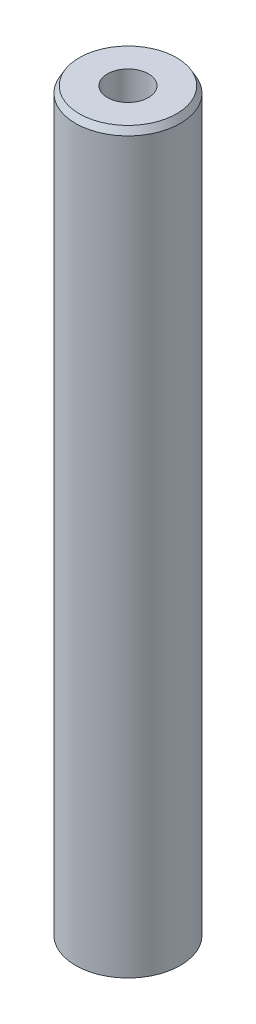
ISO-10303-21;
HEADER;
FILE_DESCRIPTION(('STEP AP214'),'2;1');
FILE_NAME('part.step','',(''),(''),'','','');
FILE_SCHEMA(('AUTOMOTIVE_DESIGN { 1 0 10303 214 1 1 1 1 }'));
ENDSEC;
DATA;
#1=APPLICATION_CONTEXT('core data for automotive mechanical design processes');
#2=APPLICATION_PROTOCOL_DEFINITION('international standard','automotive_design',2000,#1);
#3=PRODUCT_CONTEXT('',#1,'mechanical');
#4=PRODUCT('Part','Part','',(#3));
#5=PRODUCT_RELATED_PRODUCT_CATEGORY('part','',(#4));
#6=PRODUCT_DEFINITION_FORMATION('','',#4);
#7=PRODUCT_DEFINITION_CONTEXT('part definition',#1,'design');
#8=PRODUCT_DEFINITION('design','',#6,#7);
#9=PRODUCT_DEFINITION_SHAPE('','',#8);
#10=(LENGTH_UNIT() NAMED_UNIT(*) SI_UNIT(.MILLI.,.METRE.));
#11=(NAMED_UNIT(*) PLANE_ANGLE_UNIT() SI_UNIT($,.RADIAN.));
#12=(NAMED_UNIT(*) SI_UNIT($,.STERADIAN.) SOLID_ANGLE_UNIT());
#13=UNCERTAINTY_MEASURE_WITH_UNIT(LENGTH_MEASURE(1.E-05),#10,'distance_accuracy_value','');
#14=(GEOMETRIC_REPRESENTATION_CONTEXT(3) GLOBAL_UNCERTAINTY_ASSIGNED_CONTEXT((#13)) GLOBAL_UNIT_ASSIGNED_CONTEXT((#10,
#11,#12)) REPRESENTATION_CONTEXT('',''));
#15=CARTESIAN_POINT('',(0.,0.,0.));
#16=DIRECTION('',(0.,0.,1.));
#17=DIRECTION('',(1.,0.,0.));
#18=AXIS2_PLACEMENT_3D('',#15,#16,#17);
#19=CARTESIAN_POINT('',(0.,600.,0.));
#20=DIRECTION('',(0.,-1.,0.));
#21=DIRECTION('',(0.,0.,-1.));
#22=AXIS2_PLACEMENT_3D('',#19,#20,#21);
#23=CYLINDRICAL_SURFACE('',#22,42.5);
#24=CARTESIAN_POINT('',(0.,594.740714025713,0.));
#25=DIRECTION('',(0.,1.,0.));
#26=DIRECTION('',(0.,0.,1.));
#27=AXIS2_PLACEMENT_3D('',#24,#25,#26);
#28=CIRCLE('',#27,42.5);
#29=CARTESIAN_POINT('',(0.,594.740714025713,42.5));
#30=VERTEX_POINT('',#29);
#31=EDGE_CURVE('E50',#30,#30,#28,.F.);
#32=ORIENTED_EDGE('',*,*,#31,.T.);
#33=EDGE_LOOP('',(#32));
#34=FACE_BOUND('',#33,.T.);
#35=CARTESIAN_POINT('',(0.,3.03645017299958,0.));
#36=DIRECTION('',(0.,1.,0.));
#37=DIRECTION('',(0.,0.,1.));
#38=AXIS2_PLACEMENT_3D('',#35,#36,#37);
#39=CIRCLE('',#38,42.5);
#40=CARTESIAN_POINT('',(0.,3.03645017299958,42.5));
#41=VERTEX_POINT('',#40);
#42=EDGE_CURVE('E51',#41,#41,#39,.T.);
#43=ORIENTED_EDGE('',*,*,#42,.T.);
#44=EDGE_LOOP('',(#43));
#45=FACE_BOUND('',#44,.T.);
#46=ADVANCED_FACE('F39',(#34,#45),#23,.T.);
#47=CARTESIAN_POINT('',(0.,600.,0.));
#48=DIRECTION('',(0.,1.,0.));
#49=DIRECTION('',(0.,0.,1.));
#50=AXIS2_PLACEMENT_3D('',#47,#48,#49);
#51=PLANE('',#50);
#52=CARTESIAN_POINT('',(0.,600.,0.));
#53=DIRECTION('',(0.,1.,0.));
#54=DIRECTION('',(0.,0.,1.));
#55=AXIS2_PLACEMENT_3D('',#52,#53,#54);
#56=CIRCLE('',#55,39.4635498270004);
#57=CARTESIAN_POINT('',(0.,600.,39.4635498270004));
#58=VERTEX_POINT('',#57);
#59=EDGE_CURVE('E54',#58,#58,#56,.T.);
#60=ORIENTED_EDGE('',*,*,#59,.T.);
#61=EDGE_LOOP('',(#60));
#62=FACE_BOUND('',#61,.T.);
#63=CARTESIAN_POINT('',(0.,600.,0.));
#64=DIRECTION('',(0.,1.,0.));
#65=DIRECTION('',(0.,0.,1.));
#66=AXIS2_PLACEMENT_3D('',#63,#64,#65);
#67=CIRCLE('',#66,16.6773726557165);
#68=CARTESIAN_POINT('',(0.,600.,16.6773726557165));
#69=VERTEX_POINT('',#68);
#70=EDGE_CURVE('E58',#69,#69,#67,.T.);
#71=ORIENTED_EDGE('',*,*,#70,.F.);
#72=EDGE_LOOP('',(#71));
#73=FACE_BOUND('',#72,.T.);
#74=ADVANCED_FACE('F69',(#62,#73),#51,.T.);
#75=CARTESIAN_POINT('',(0.,0.,0.));
#76=DIRECTION('',(0.,1.,0.));
#77=DIRECTION('',(0.,0.,1.));
#78=AXIS2_PLACEMENT_3D('',#75,#76,#77);
#79=PLANE('',#78);
#80=CARTESIAN_POINT('',(0.,0.,0.));
#81=DIRECTION('',(0.,1.,0.));
#82=DIRECTION('',(0.,0.,1.));
#83=AXIS2_PLACEMENT_3D('',#80,#81,#82);
#84=CIRCLE('',#83,37.2407140257134);
#85=CARTESIAN_POINT('',(0.,0.,37.2407140257134));
#86=VERTEX_POINT('',#85);
#87=EDGE_CURVE('E10',#86,#86,#84,.F.);
#88=ORIENTED_EDGE('',*,*,#87,.T.);
#89=EDGE_LOOP('',(#88));
#90=FACE_BOUND('',#89,.T.);
#91=CARTESIAN_POINT('',(0.,0.,0.));
#92=DIRECTION('',(0.,1.,0.));
#93=DIRECTION('',(0.,0.,1.));
#94=AXIS2_PLACEMENT_3D('',#91,#92,#93);
#95=CIRCLE('',#94,16.6773726557165);
#96=CARTESIAN_POINT('',(0.,0.,16.6773726557165));
#97=VERTEX_POINT('',#96);
#98=EDGE_CURVE('E63',#97,#97,#95,.T.);
#99=ORIENTED_EDGE('',*,*,#98,.T.);
#100=EDGE_LOOP('',(#99));
#101=FACE_BOUND('',#100,.T.);
#102=ADVANCED_FACE('F75',(#90,#101),#79,.F.);
#103=CARTESIAN_POINT('',(0.,600.,0.));
#104=DIRECTION('',(0.,-1.,0.));
#105=DIRECTION('',(0.,0.,-1.));
#106=AXIS2_PLACEMENT_3D('',#103,#104,#105);
#107=CYLINDRICAL_SURFACE('',#106,16.6773726557165);
#108=ORIENTED_EDGE('',*,*,#70,.T.);
#109=EDGE_LOOP('',(#108));
#110=FACE_BOUND('',#109,.T.);
#111=ORIENTED_EDGE('',*,*,#98,.F.);
#112=EDGE_LOOP('',(#111));
#113=FACE_BOUND('',#112,.T.);
#114=ADVANCED_FACE('F70',(#110,#113),#107,.F.);
#115=CARTESIAN_POINT('',(0.,600.,0.));
#116=DIRECTION('',(0.,-1.,0.));
#117=DIRECTION('',(0.,0.,-1.));
#118=AXIS2_PLACEMENT_3D('',#115,#116,#117);
#119=CONICAL_SURFACE('',#118,39.4635498270004,0.523598775598293);
#120=ORIENTED_EDGE('',*,*,#31,.F.);
#121=EDGE_LOOP('',(#120));
#122=FACE_BOUND('',#121,.T.);
#123=ORIENTED_EDGE('',*,*,#59,.F.);
#124=EDGE_LOOP('',(#123));
#125=FACE_BOUND('',#124,.T.);
#126=ADVANCED_FACE('F81',(#122,#125),#119,.T.);
#127=CARTESIAN_POINT('',(0.,3.03645017299958,0.));
#128=DIRECTION('',(0.,1.,0.));
#129=DIRECTION('',(0.,0.,1.));
#130=AXIS2_PLACEMENT_3D('',#127,#128,#129);
#131=CONICAL_SURFACE('',#130,42.5,1.0471975511966);
#132=CARTESIAN_POINT('',(0.,0.,37.2407140257134));
#133=CARTESIAN_POINT('',(0.,0.0316296893020786,37.2954982546122));
#134=CARTESIAN_POINT('',(0.,0.0632593786041575,37.350282483511));
#135=CARTESIAN_POINT('',(0.,0.126518757208316,37.4598509413087));
#136=CARTESIAN_POINT('',(0.,0.158148446510395,37.5146351702075));
#137=CARTESIAN_POINT('',(0.,0.221407825114552,37.6242036280051));
#138=CARTESIAN_POINT('',(0.,0.253037514416631,37.6789878569039));
#139=CARTESIAN_POINT('',(0.,0.316296893020789,37.7885563147016));
#140=CARTESIAN_POINT('',(0.,0.347926582322868,37.8433405436004));
#141=CARTESIAN_POINT('',(0.,0.411185960927026,37.952909001398));
#142=CARTESIAN_POINT('',(0.,0.442815650229105,38.0076932302968));
#143=CARTESIAN_POINT('',(0.,0.506075028833264,38.1172616880945));
#144=CARTESIAN_POINT('',(0.,0.537704718135343,38.1720459169933));
#145=CARTESIAN_POINT('',(0.,0.600964096739501,38.2816143747909));
#146=CARTESIAN_POINT('',(0.,0.632593786041579,38.3363986036898));
#147=CARTESIAN_POINT('',(0.,0.695853164645737,38.4459670614874));
#148=CARTESIAN_POINT('',(0.,0.727482853947816,38.5007512903862));
#149=CARTESIAN_POINT('',(0.,0.790742232551975,38.6103197481839));
#150=CARTESIAN_POINT('',(0.,0.822371921854053,38.6651039770827));
#151=CARTESIAN_POINT('',(0.,0.885631300458211,38.7746724348803));
#152=CARTESIAN_POINT('',(0.,0.91726098976029,38.8294566637791));
#153=CARTESIAN_POINT('',(0.,0.980520368364448,38.9390251215768));
#154=CARTESIAN_POINT('',(0.,1.01215005766653,38.9938093504756));
#155=CARTESIAN_POINT('',(0.,1.07540943627069,39.1033778082732));
#156=CARTESIAN_POINT('',(0.,1.10703912557276,39.158162037172));
#157=CARTESIAN_POINT('',(0.,1.17029850417692,39.2677304949697));
#158=CARTESIAN_POINT('',(0.,1.201928193479,39.3225147238685));
#159=CARTESIAN_POINT('',(0.,1.26518757208316,39.4320831816661));
#160=CARTESIAN_POINT('',(0.,1.29681726138524,39.486867410565));
#161=CARTESIAN_POINT('',(0.,1.3600766399894,39.5964358683626));
#162=CARTESIAN_POINT('',(0.,1.39170632929148,39.6512200972614));
#163=CARTESIAN_POINT('',(0.,1.45496570789563,39.7607885550591));
#164=CARTESIAN_POINT('',(0.,1.48659539719771,39.8155727839579));
#165=CARTESIAN_POINT('',(0.,1.54985477580187,39.9251412417555));
#166=CARTESIAN_POINT('',(0.,1.58148446510395,39.9799254706543));
#167=CARTESIAN_POINT('',(0.,1.64474384370811,40.089493928452));
#168=CARTESIAN_POINT('',(0.,1.67637353301019,40.1442781573508));
#169=CARTESIAN_POINT('',(0.,1.73963291161434,40.2538466151484));
#170=CARTESIAN_POINT('',(0.,1.77126260091642,40.3086308440472));
#171=CARTESIAN_POINT('',(0.,1.83452197952058,40.4181993018449));
#172=CARTESIAN_POINT('',(0.,1.86615166882266,40.4729835307437));
#173=CARTESIAN_POINT('',(0.,1.92941104742682,40.5825519885413));
#174=CARTESIAN_POINT('',(0.,1.9610407367289,40.6373362174402));
#175=CARTESIAN_POINT('',(0.,2.02430011533306,40.7469046752378));
#176=CARTESIAN_POINT('',(0.,2.05592980463513,40.8016889041366));
#177=CARTESIAN_POINT('',(0.,2.11918918323929,40.9112573619343));
#178=CARTESIAN_POINT('',(0.,2.15081887254137,40.9660415908331));
#179=CARTESIAN_POINT('',(0.,2.21407825114553,41.0756100486307));
#180=CARTESIAN_POINT('',(0.,2.24570794044761,41.1303942775295));
#181=CARTESIAN_POINT('',(0.,2.30896731905177,41.2399627353272));
#182=CARTESIAN_POINT('',(0.,2.34059700835385,41.294746964226));
#183=CARTESIAN_POINT('',(0.,2.403856386958,41.4043154220236));
#184=CARTESIAN_POINT('',(0.,2.43548607626008,41.4590996509224));
#185=CARTESIAN_POINT('',(0.,2.49874545486424,41.5686681087201));
#186=CARTESIAN_POINT('',(0.,2.53037514416632,41.6234523376189));
#187=CARTESIAN_POINT('',(0.,2.59363452277048,41.7330207954165));
#188=CARTESIAN_POINT('',(0.,2.62526421207256,41.7878050243154));
#189=CARTESIAN_POINT('',(0.,2.68852359067671,41.897373482113));
#190=CARTESIAN_POINT('',(0.,2.72015327997879,41.9521577110118));
#191=CARTESIAN_POINT('',(0.,2.78341265858295,42.0617261688095));
#192=CARTESIAN_POINT('',(0.,2.81504234788503,42.1165103977083));
#193=CARTESIAN_POINT('',(0.,2.87830172648919,42.2260788555059));
#194=CARTESIAN_POINT('',(0.,2.90993141579127,42.2808630844047));
#195=CARTESIAN_POINT('',(0.,2.97319079439542,42.3904315422024));
#196=CARTESIAN_POINT('',(0.,3.0048204836975,42.4452157711012));
#197=CARTESIAN_POINT('',(0.,3.03645017299958,42.5));
#198=B_SPLINE_CURVE_WITH_KNOTS('',3,(#132,#133,#134,#135,#136,#137,#138,#139,#140,#141,#142,
#143,#144,#145,#146,#147,#148,#149,#150,#151,#152,#153,#154,#155,#156,#157,#158,#159,#160,#161,
#162,#163,#164,#165,#166,#167,#168,#169,#170,#171,#172,#173,#174,#175,#176,#177,#178,#179,#180,
#181,#182,#183,#184,#185,#186,#187,#188,#189,#190,#191,#192,#193,#194,#195,#196,#197),
.UNSPECIFIED.,.F.,.F.,(4,2,2,2,2,2,2,2,2,2,2,2,2,2,2,2,2,2,2,2,2,2,2,2,2,2,2,2,2,2,2,2,4),(0.,
0.189778135812474,0.379556271624949,0.569334407437423,0.759112543249897,0.948890679062371,
1.13866881487485,1.32844695068733,1.5182250864998,1.70800322231227,1.89778135812475,
2.08755949393722,2.2773376297497,2.46711576556218,2.65689390137465,2.84667203718713,
3.0364501729996,3.22622830881208,3.41600644462455,3.60578458043702,3.7955627162495,
3.98534085206197,4.17511898787445,4.36489712368693,4.5546752594994,4.74445339531188,
4.93423153112435,5.12400966693682,5.3137878027493,5.50356593856178,5.69334407437425,
5.88312221018673,6.0729003459992),.UNSPECIFIED.);
#199=EDGE_CURVE('BSEAM45',#86,#41,#198,.T.);
#200=ORIENTED_EDGE('',*,*,#87,.F.);
#201=ORIENTED_EDGE('',*,*,#42,.F.);
#202=ORIENTED_EDGE('',*,*,#199,.T.);
#203=ORIENTED_EDGE('',*,*,#199,.F.);
#204=EDGE_LOOP('',(#200,#202,#201,#203));
#205=FACE_BOUND('',#204,.T.);
#206=ADVANCED_FACE('F45',(#205),#131,.T.);
#207=CLOSED_SHELL('',(#46,#74,#102,#114,#126,#206));
#208=MANIFOLD_SOLID_BREP('B2',#207);
#209=ADVANCED_BREP_SHAPE_REPRESENTATION('',(#18,#208),#14);
#210=SHAPE_DEFINITION_REPRESENTATION(#9,#209);
ENDSEC;
END-ISO-10303-21;
